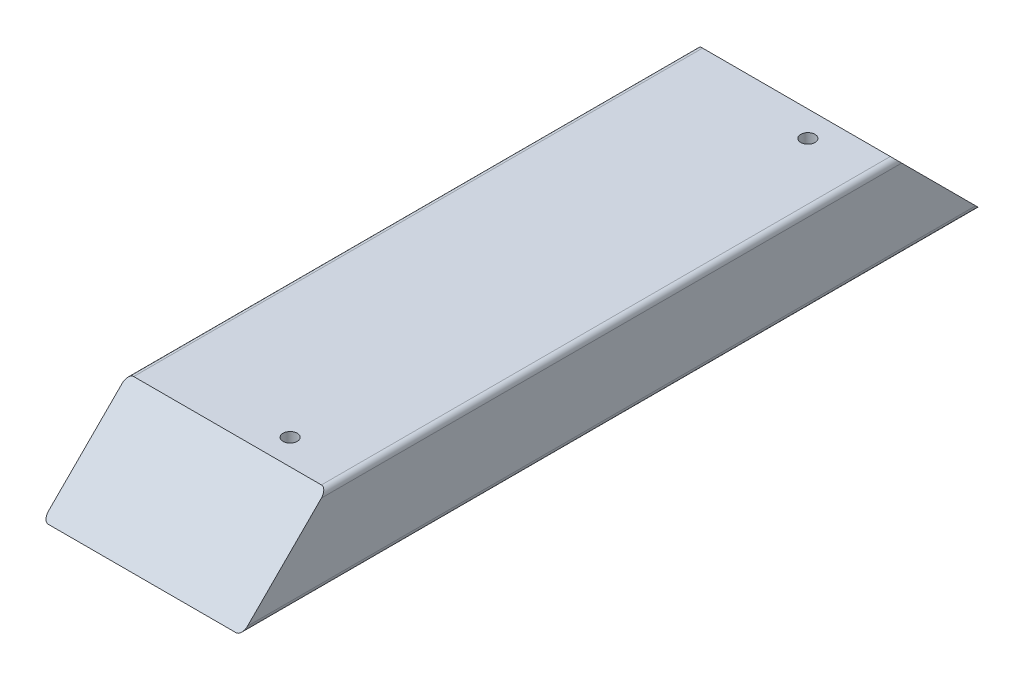
ISO-10303-21;
HEADER;
FILE_DESCRIPTION(('STEP AP214'),'2;1');
FILE_NAME('part.step','',(''),(''),'','','');
FILE_SCHEMA(('AUTOMOTIVE_DESIGN { 1 0 10303 214 1 1 1 1 }'));
ENDSEC;
DATA;
#1=APPLICATION_CONTEXT('core data for automotive mechanical design processes');
#2=APPLICATION_PROTOCOL_DEFINITION('international standard','automotive_design',2000,#1);
#3=PRODUCT_CONTEXT('',#1,'mechanical');
#4=PRODUCT('Part','Part','',(#3));
#5=PRODUCT_RELATED_PRODUCT_CATEGORY('part','',(#4));
#6=PRODUCT_DEFINITION_FORMATION('','',#4);
#7=PRODUCT_DEFINITION_CONTEXT('part definition',#1,'design');
#8=PRODUCT_DEFINITION('design','',#6,#7);
#9=PRODUCT_DEFINITION_SHAPE('','',#8);
#10=(LENGTH_UNIT() NAMED_UNIT(*) SI_UNIT(.MILLI.,.METRE.));
#11=(NAMED_UNIT(*) PLANE_ANGLE_UNIT() SI_UNIT($,.RADIAN.));
#12=(NAMED_UNIT(*) SI_UNIT($,.STERADIAN.) SOLID_ANGLE_UNIT());
#13=UNCERTAINTY_MEASURE_WITH_UNIT(LENGTH_MEASURE(1.E-05),#10,'distance_accuracy_value','');
#14=(GEOMETRIC_REPRESENTATION_CONTEXT(3) GLOBAL_UNCERTAINTY_ASSIGNED_CONTEXT((#13)) GLOBAL_UNIT_ASSIGNED_CONTEXT((#10,
#11,#12)) REPRESENTATION_CONTEXT('',''));
#15=CARTESIAN_POINT('',(0.,0.,0.));
#16=DIRECTION('',(0.,0.,1.));
#17=DIRECTION('',(1.,0.,0.));
#18=AXIS2_PLACEMENT_3D('',#15,#16,#17);
#19=CARTESIAN_POINT('',(44.45,19.05,330.2));
#20=DIRECTION('',(-1.,0.,0.));
#21=DIRECTION('',(0.,-1.,0.));
#22=AXIS2_PLACEMENT_3D('',#19,#20,#21);
#23=PLANE('',#22);
#24=DIRECTION('',(0.,0.707106781186552,-0.707106781186544));
#25=VECTOR('',#24,1.);
#26=CARTESIAN_POINT('',(44.45,2.15105711021124E-13,311.15));
#27=LINE('',#26,#25);
#28=CARTESIAN_POINT('',(44.45,-16.51,327.66));
#29=VERTEX_POINT('',#28);
#30=CARTESIAN_POINT('',(44.45,16.51,294.64));
#31=VERTEX_POINT('',#30);
#32=EDGE_CURVE('E183',#29,#31,#27,.T.);
#33=ORIENTED_EDGE('',*,*,#32,.F.);
#34=DIRECTION('',(0.,0.,-1.));
#35=VECTOR('',#34,1.);
#36=CARTESIAN_POINT('',(44.45,-16.51,330.2));
#37=LINE('',#36,#35);
#38=CARTESIAN_POINT('',(44.45,-16.51,2.53999999999996));
#39=VERTEX_POINT('',#38);
#40=EDGE_CURVE('E121',#29,#39,#37,.T.);
#41=ORIENTED_EDGE('',*,*,#40,.T.);
#42=DIRECTION('',(0.,0.707106781186552,0.707106781186544));
#43=VECTOR('',#42,1.);
#44=CARTESIAN_POINT('',(44.45,165.1,184.149999999998));
#45=LINE('',#44,#43);
#46=CARTESIAN_POINT('',(44.45,16.51,35.5599999999996));
#47=VERTEX_POINT('',#46);
#48=EDGE_CURVE('E181',#39,#47,#45,.T.);
#49=ORIENTED_EDGE('',*,*,#48,.T.);
#50=DIRECTION('',(0.,0.,-1.));
#51=VECTOR('',#50,1.);
#52=CARTESIAN_POINT('',(44.45,16.51,330.2));
#53=LINE('',#52,#51);
#54=EDGE_CURVE('E118',#47,#31,#53,.F.);
#55=ORIENTED_EDGE('',*,*,#54,.T.);
#56=EDGE_LOOP('',(#33,#41,#49,#55));
#57=FACE_BOUND('',#56,.T.);
#58=ADVANCED_FACE('F35',(#57),#23,.F.);
#59=CARTESIAN_POINT('',(-44.45,19.05,330.2));
#60=DIRECTION('',(0.,-1.,0.));
#61=DIRECTION('',(0.,0.,-1.));
#62=AXIS2_PLACEMENT_3D('',#59,#60,#61);
#63=PLANE('',#62);
#64=CARTESIAN_POINT('',(16.51,19.05,280.67));
#65=DIRECTION('',(0.,-1.,0.));
#66=DIRECTION('',(0.,0.,-1.));
#67=AXIS2_PLACEMENT_3D('',#64,#65,#66);
#68=CIRCLE('',#67,3.175);
#69=CARTESIAN_POINT('',(16.51,19.05,277.495));
#70=VERTEX_POINT('',#69);
#71=EDGE_CURVE('E210',#70,#70,#68,.T.);
#72=ORIENTED_EDGE('',*,*,#71,.T.);
#73=EDGE_LOOP('',(#72));
#74=FACE_BOUND('',#73,.T.);
#75=CARTESIAN_POINT('',(16.51,19.05,49.5299999999996));
#76=DIRECTION('',(0.,1.,0.));
#77=DIRECTION('',(0.,0.,1.));
#78=AXIS2_PLACEMENT_3D('',#75,#76,#77);
#79=CIRCLE('',#78,3.175);
#80=CARTESIAN_POINT('',(16.51,19.05,52.7049999999996));
#81=VERTEX_POINT('',#80);
#82=EDGE_CURVE('E204',#81,#81,#79,.T.);
#83=ORIENTED_EDGE('',*,*,#82,.F.);
#84=EDGE_LOOP('',(#83));
#85=FACE_BOUND('',#84,.T.);
#86=DIRECTION('',(-1.,0.,0.));
#87=VECTOR('',#86,1.);
#88=CARTESIAN_POINT('',(361.95,19.05,292.1));
#89=LINE('',#88,#87);
#90=CARTESIAN_POINT('',(41.91,19.05,292.1));
#91=VERTEX_POINT('',#90);
#92=CARTESIAN_POINT('',(-41.91,19.05,292.1));
#93=VERTEX_POINT('',#92);
#94=EDGE_CURVE('E50',#91,#93,#89,.T.);
#95=ORIENTED_EDGE('',*,*,#94,.F.);
#96=DIRECTION('',(0.,0.,-1.));
#97=VECTOR('',#96,1.);
#98=CARTESIAN_POINT('',(41.91,19.05,330.2));
#99=LINE('',#98,#97);
#100=CARTESIAN_POINT('',(41.91,19.05,38.0999999999996));
#101=VERTEX_POINT('',#100);
#102=EDGE_CURVE('E130',#91,#101,#99,.T.);
#103=ORIENTED_EDGE('',*,*,#102,.T.);
#104=DIRECTION('',(-1.,0.,0.));
#105=VECTOR('',#104,1.);
#106=CARTESIAN_POINT('',(361.95,19.05,38.0999999999996));
#107=LINE('',#106,#105);
#108=CARTESIAN_POINT('',(-41.91,19.05,38.0999999999996));
#109=VERTEX_POINT('',#108);
#110=EDGE_CURVE('E136',#101,#109,#107,.T.);
#111=ORIENTED_EDGE('',*,*,#110,.T.);
#112=DIRECTION('',(0.,0.,-1.));
#113=VECTOR('',#112,1.);
#114=CARTESIAN_POINT('',(-41.91,19.05,330.2));
#115=LINE('',#114,#113);
#116=EDGE_CURVE('E127',#109,#93,#115,.F.);
#117=ORIENTED_EDGE('',*,*,#116,.T.);
#118=EDGE_LOOP('',(#95,#103,#111,#117));
#119=FACE_BOUND('',#118,.T.);
#120=ADVANCED_FACE('F141',(#74,#85,#119),#63,.F.);
#121=CARTESIAN_POINT('',(-44.45,19.05,330.2));
#122=DIRECTION('',(1.,0.,0.));
#123=DIRECTION('',(0.,0.,-1.));
#124=AXIS2_PLACEMENT_3D('',#121,#122,#123);
#125=PLANE('',#124);
#126=DIRECTION('',(0.,0.707106781186551,-0.707106781186543));
#127=VECTOR('',#126,1.);
#128=CARTESIAN_POINT('',(-44.45,-19.05,330.2));
#129=LINE('',#128,#127);
#130=CARTESIAN_POINT('',(-44.45,-16.51,327.66));
#131=VERTEX_POINT('',#130);
#132=CARTESIAN_POINT('',(-44.45,16.51,294.64));
#133=VERTEX_POINT('',#132);
#134=EDGE_CURVE('E98',#131,#133,#129,.T.);
#135=ORIENTED_EDGE('',*,*,#134,.T.);
#136=DIRECTION('',(0.,0.,-1.));
#137=VECTOR('',#136,1.);
#138=CARTESIAN_POINT('',(-44.45,16.51,330.2));
#139=LINE('',#138,#137);
#140=CARTESIAN_POINT('',(-44.45,16.51,35.5599999999996));
#141=VERTEX_POINT('',#140);
#142=EDGE_CURVE('E57',#133,#141,#139,.T.);
#143=ORIENTED_EDGE('',*,*,#142,.T.);
#144=DIRECTION('',(0.,0.707106781186551,0.707106781186543));
#145=VECTOR('',#144,1.);
#146=CARTESIAN_POINT('',(-44.45,-19.05,0.));
#147=LINE('',#146,#145);
#148=CARTESIAN_POINT('',(-44.45,-16.51,2.53999999999998));
#149=VERTEX_POINT('',#148);
#150=EDGE_CURVE('E114',#149,#141,#147,.T.);
#151=ORIENTED_EDGE('',*,*,#150,.F.);
#152=DIRECTION('',(0.,0.,-1.));
#153=VECTOR('',#152,1.);
#154=CARTESIAN_POINT('',(-44.45,-16.51,330.2));
#155=LINE('',#154,#153);
#156=EDGE_CURVE('E111',#149,#131,#155,.F.);
#157=ORIENTED_EDGE('',*,*,#156,.T.);
#158=EDGE_LOOP('',(#135,#143,#151,#157));
#159=FACE_BOUND('',#158,.T.);
#160=ADVANCED_FACE('F117',(#159),#125,.F.);
#161=CARTESIAN_POINT('',(-41.91,-16.51,330.2));
#162=DIRECTION('',(0.,0.,-1.));
#163=DIRECTION('',(-1.,0.,0.));
#164=AXIS2_PLACEMENT_3D('',#161,#162,#163);
#165=CYLINDRICAL_SURFACE('',#164,2.54);
#166=DIRECTION('',(0.,0.,-1.));
#167=VECTOR('',#166,1.);
#168=CARTESIAN_POINT('',(-41.91,-19.05,330.2));
#169=LINE('',#168,#167);
#170=CARTESIAN_POINT('',(-41.91,-19.05,330.2));
#171=VERTEX_POINT('',#170);
#172=CARTESIAN_POINT('',(-41.91,-19.05,0.));
#173=VERTEX_POINT('',#172);
#174=EDGE_CURVE('E113',#171,#173,#169,.T.);
#175=ORIENTED_EDGE('',*,*,#174,.F.);
#176=CARTESIAN_POINT('',(-41.91,-16.51,327.66));
#177=DIRECTION('',(0.,0.707106781186543,0.707106781186551));
#178=DIRECTION('',(0.,0.707106781186552,-0.707106781186544));
#179=AXIS2_PLACEMENT_3D('',#176,#177,#178);
#180=ELLIPSE('',#179,3.59210244842764,2.54);
#181=EDGE_CURVE('E101',#171,#131,#180,.F.);
#182=ORIENTED_EDGE('',*,*,#181,.T.);
#183=ORIENTED_EDGE('',*,*,#156,.F.);
#184=CARTESIAN_POINT('',(-41.91,-16.51,2.53999999999993));
#185=DIRECTION('',(0.,-0.707106781186543,0.707106781186551));
#186=DIRECTION('',(0.,-0.707106781186552,-0.707106781186544));
#187=AXIS2_PLACEMENT_3D('',#184,#185,#186);
#188=ELLIPSE('',#187,3.59210244842764,2.54);
#189=EDGE_CURVE('E186',#173,#149,#188,.F.);
#190=ORIENTED_EDGE('',*,*,#189,.F.);
#191=EDGE_LOOP('',(#175,#182,#183,#190));
#192=FACE_BOUND('',#191,.T.);
#193=ADVANCED_FACE('F109',(#192),#165,.T.);
#194=CARTESIAN_POINT('',(41.91,-16.51,330.2));
#195=DIRECTION('',(0.,0.,-1.));
#196=DIRECTION('',(-1.,0.,0.));
#197=AXIS2_PLACEMENT_3D('',#194,#195,#196);
#198=CYLINDRICAL_SURFACE('',#197,2.54);
#199=ORIENTED_EDGE('',*,*,#40,.F.);
#200=CARTESIAN_POINT('',(41.91,-16.51,327.66));
#201=DIRECTION('',(0.,0.707106781186543,0.707106781186551));
#202=DIRECTION('',(0.,0.707106781186552,-0.707106781186544));
#203=AXIS2_PLACEMENT_3D('',#200,#201,#202);
#204=ELLIPSE('',#203,3.59210244842764,2.54);
#205=CARTESIAN_POINT('',(41.91,-19.05,330.2));
#206=VERTEX_POINT('',#205);
#207=EDGE_CURVE('E115',#29,#206,#204,.F.);
#208=ORIENTED_EDGE('',*,*,#207,.T.);
#209=DIRECTION('',(0.,0.,-1.));
#210=VECTOR('',#209,1.);
#211=CARTESIAN_POINT('',(41.91,-19.05,330.2));
#212=LINE('',#211,#210);
#213=CARTESIAN_POINT('',(41.91,-19.05,0.));
#214=VERTEX_POINT('',#213);
#215=EDGE_CURVE('E194',#214,#206,#212,.F.);
#216=ORIENTED_EDGE('',*,*,#215,.F.);
#217=CARTESIAN_POINT('',(41.91,-16.51,2.53999999999993));
#218=DIRECTION('',(0.,-0.707106781186543,0.707106781186551));
#219=DIRECTION('',(0.,-0.707106781186552,-0.707106781186544));
#220=AXIS2_PLACEMENT_3D('',#217,#218,#219);
#221=ELLIPSE('',#220,3.59210244842764,2.54);
#222=EDGE_CURVE('E178',#39,#214,#221,.F.);
#223=ORIENTED_EDGE('',*,*,#222,.F.);
#224=EDGE_LOOP('',(#199,#208,#216,#223));
#225=FACE_BOUND('',#224,.T.);
#226=ADVANCED_FACE('F154',(#225),#198,.T.);
#227=CARTESIAN_POINT('',(41.91,16.51,330.2));
#228=DIRECTION('',(0.,0.,-1.));
#229=DIRECTION('',(-1.,0.,0.));
#230=AXIS2_PLACEMENT_3D('',#227,#228,#229);
#231=CYLINDRICAL_SURFACE('',#230,2.54);
#232=ORIENTED_EDGE('',*,*,#102,.F.);
#233=CARTESIAN_POINT('',(41.91,16.51,294.64));
#234=DIRECTION('',(0.,0.707106781186543,0.707106781186551));
#235=DIRECTION('',(0.,0.707106781186552,-0.707106781186544));
#236=AXIS2_PLACEMENT_3D('',#233,#234,#235);
#237=ELLIPSE('',#236,3.59210244842764,2.54);
#238=EDGE_CURVE('E198',#91,#31,#237,.F.);
#239=ORIENTED_EDGE('',*,*,#238,.T.);
#240=ORIENTED_EDGE('',*,*,#54,.F.);
#241=CARTESIAN_POINT('',(41.91,16.51,35.5599999999996));
#242=DIRECTION('',(0.,-0.707106781186543,0.707106781186551));
#243=DIRECTION('',(0.,-0.707106781186552,-0.707106781186544));
#244=AXIS2_PLACEMENT_3D('',#241,#242,#243);
#245=ELLIPSE('',#244,3.59210244842764,2.54);
#246=EDGE_CURVE('E143',#101,#47,#245,.F.);
#247=ORIENTED_EDGE('',*,*,#246,.F.);
#248=EDGE_LOOP('',(#232,#239,#240,#247));
#249=FACE_BOUND('',#248,.T.);
#250=ADVANCED_FACE('F147',(#249),#231,.T.);
#251=CARTESIAN_POINT('',(-41.91,16.51,330.2));
#252=DIRECTION('',(0.,0.,-1.));
#253=DIRECTION('',(-1.,0.,0.));
#254=AXIS2_PLACEMENT_3D('',#251,#252,#253);
#255=CYLINDRICAL_SURFACE('',#254,2.54);
#256=ORIENTED_EDGE('',*,*,#142,.F.);
#257=CARTESIAN_POINT('',(-41.91,16.51,294.64));
#258=DIRECTION('',(0.,0.707106781186543,0.707106781186551));
#259=DIRECTION('',(0.,0.707106781186552,-0.707106781186544));
#260=AXIS2_PLACEMENT_3D('',#257,#258,#259);
#261=ELLIPSE('',#260,3.59210244842764,2.54);
#262=EDGE_CURVE('E11',#133,#93,#261,.F.);
#263=ORIENTED_EDGE('',*,*,#262,.T.);
#264=ORIENTED_EDGE('',*,*,#116,.F.);
#265=CARTESIAN_POINT('',(-41.91,16.51,35.5599999999996));
#266=DIRECTION('',(0.,-0.707106781186543,0.707106781186551));
#267=DIRECTION('',(0.,-0.707106781186552,-0.707106781186544));
#268=AXIS2_PLACEMENT_3D('',#265,#266,#267);
#269=ELLIPSE('',#268,3.59210244842764,2.54);
#270=EDGE_CURVE('E43',#141,#109,#269,.F.);
#271=ORIENTED_EDGE('',*,*,#270,.F.);
#272=EDGE_LOOP('',(#256,#263,#264,#271));
#273=FACE_BOUND('',#272,.T.);
#274=ADVANCED_FACE('F37',(#273),#255,.T.);
#275=CARTESIAN_POINT('',(-44.45,-19.05,330.2));
#276=DIRECTION('',(0.,1.,0.));
#277=DIRECTION('',(0.,0.,1.));
#278=AXIS2_PLACEMENT_3D('',#275,#276,#277);
#279=PLANE('',#278);
#280=DIRECTION('',(1.,0.,0.));
#281=VECTOR('',#280,1.);
#282=CARTESIAN_POINT('',(-44.45,-19.05,330.2));
#283=LINE('',#282,#281);
#284=EDGE_CURVE('E192',#171,#206,#283,.T.);
#285=ORIENTED_EDGE('',*,*,#284,.F.);
#286=ORIENTED_EDGE('',*,*,#174,.T.);
#287=DIRECTION('',(1.,0.,0.));
#288=VECTOR('',#287,1.);
#289=CARTESIAN_POINT('',(-44.45,-19.05,0.));
#290=LINE('',#289,#288);
#291=EDGE_CURVE('E191',#173,#214,#290,.T.);
#292=ORIENTED_EDGE('',*,*,#291,.T.);
#293=ORIENTED_EDGE('',*,*,#215,.T.);
#294=EDGE_LOOP('',(#285,#286,#292,#293));
#295=FACE_BOUND('',#294,.T.);
#296=ADVANCED_FACE('F146',(#295),#279,.F.);
#297=CARTESIAN_POINT('',(361.95,-19.05,0.));
#298=DIRECTION('',(0.,-0.707106781186543,0.707106781186551));
#299=DIRECTION('',(0.,-0.707106781186552,-0.707106781186544));
#300=AXIS2_PLACEMENT_3D('',#297,#298,#299);
#301=PLANE('',#300);
#302=ORIENTED_EDGE('',*,*,#189,.T.);
#303=ORIENTED_EDGE('',*,*,#150,.T.);
#304=ORIENTED_EDGE('',*,*,#270,.T.);
#305=ORIENTED_EDGE('',*,*,#110,.F.);
#306=ORIENTED_EDGE('',*,*,#246,.T.);
#307=ORIENTED_EDGE('',*,*,#48,.F.);
#308=ORIENTED_EDGE('',*,*,#222,.T.);
#309=ORIENTED_EDGE('',*,*,#291,.F.);
#310=EDGE_LOOP('',(#302,#303,#304,#305,#306,#307,#308,#309));
#311=FACE_BOUND('',#310,.T.);
#312=ADVANCED_FACE('F135',(#311),#301,.F.);
#313=CARTESIAN_POINT('',(361.95,-19.05,330.2));
#314=DIRECTION('',(0.,0.707106781186543,0.707106781186551));
#315=DIRECTION('',(0.,-0.707106781186552,0.707106781186544));
#316=AXIS2_PLACEMENT_3D('',#313,#314,#315);
#317=PLANE('',#316);
#318=ORIENTED_EDGE('',*,*,#284,.T.);
#319=ORIENTED_EDGE('',*,*,#207,.F.);
#320=ORIENTED_EDGE('',*,*,#32,.T.);
#321=ORIENTED_EDGE('',*,*,#238,.F.);
#322=ORIENTED_EDGE('',*,*,#94,.T.);
#323=ORIENTED_EDGE('',*,*,#262,.F.);
#324=ORIENTED_EDGE('',*,*,#134,.F.);
#325=ORIENTED_EDGE('',*,*,#181,.F.);
#326=EDGE_LOOP('',(#318,#319,#320,#321,#322,#323,#324,#325));
#327=FACE_BOUND('',#326,.T.);
#328=ADVANCED_FACE('F100',(#327),#317,.T.);
#329=CARTESIAN_POINT('',(16.51,6.35,49.5299999999996));
#330=DIRECTION('',(0.,1.,0.));
#331=DIRECTION('',(0.,0.,1.));
#332=AXIS2_PLACEMENT_3D('',#329,#330,#331);
#333=CYLINDRICAL_SURFACE('',#332,3.175);
#334=CARTESIAN_POINT('',(16.51,6.35,49.5299999999996));
#335=DIRECTION('',(0.,1.,0.));
#336=DIRECTION('',(0.,0.,1.));
#337=AXIS2_PLACEMENT_3D('',#334,#335,#336);
#338=CIRCLE('',#337,3.175);
#339=CARTESIAN_POINT('',(16.51,6.35,52.7049999999996));
#340=VERTEX_POINT('',#339);
#341=EDGE_CURVE('E104',#340,#340,#338,.T.);
#342=ORIENTED_EDGE('',*,*,#341,.F.);
#343=EDGE_LOOP('',(#342));
#344=FACE_BOUND('',#343,.T.);
#345=ORIENTED_EDGE('',*,*,#82,.T.);
#346=EDGE_LOOP('',(#345));
#347=FACE_BOUND('',#346,.T.);
#348=ADVANCED_FACE('F230',(#344,#347),#333,.F.);
#349=CARTESIAN_POINT('',(16.51,6.35,49.5299999999996));
#350=DIRECTION('',(0.,1.,0.));
#351=DIRECTION('',(0.,0.,1.));
#352=AXIS2_PLACEMENT_3D('',#349,#350,#351);
#353=PLANE('',#352);
#354=ORIENTED_EDGE('',*,*,#341,.T.);
#355=EDGE_LOOP('',(#354));
#356=FACE_BOUND('',#355,.T.);
#357=ADVANCED_FACE('F225',(#356),#353,.T.);
#358=CARTESIAN_POINT('',(16.51,6.35,280.67));
#359=DIRECTION('',(0.,1.,0.));
#360=DIRECTION('',(0.,0.,1.));
#361=AXIS2_PLACEMENT_3D('',#358,#359,#360);
#362=CYLINDRICAL_SURFACE('',#361,3.175);
#363=CARTESIAN_POINT('',(16.51,6.35,280.67));
#364=DIRECTION('',(0.,-1.,0.));
#365=DIRECTION('',(0.,0.,-1.));
#366=AXIS2_PLACEMENT_3D('',#363,#364,#365);
#367=CIRCLE('',#366,3.175);
#368=CARTESIAN_POINT('',(16.51,6.35,277.495));
#369=VERTEX_POINT('',#368);
#370=EDGE_CURVE('E207',#369,#369,#367,.T.);
#371=ORIENTED_EDGE('',*,*,#370,.T.);
#372=EDGE_LOOP('',(#371));
#373=FACE_BOUND('',#372,.T.);
#374=ORIENTED_EDGE('',*,*,#71,.F.);
#375=EDGE_LOOP('',(#374));
#376=FACE_BOUND('',#375,.T.);
#377=ADVANCED_FACE('F216',(#373,#376),#362,.F.);
#378=CARTESIAN_POINT('',(16.51,6.35,280.67));
#379=DIRECTION('',(0.,1.,0.));
#380=DIRECTION('',(0.,0.,-1.));
#381=AXIS2_PLACEMENT_3D('',#378,#379,#380);
#382=PLANE('',#381);
#383=ORIENTED_EDGE('',*,*,#370,.F.);
#384=EDGE_LOOP('',(#383));
#385=FACE_BOUND('',#384,.T.);
#386=ADVANCED_FACE('F219',(#385),#382,.T.);
#387=CLOSED_SHELL('',(#58,#120,#160,#193,#226,#250,#274,#296,#312,#328,#348,#357,#377,#386));
#388=MANIFOLD_SOLID_BREP('B2',#387);
#389=ADVANCED_BREP_SHAPE_REPRESENTATION('',(#18,#388),#14);
#390=SHAPE_DEFINITION_REPRESENTATION(#9,#389);
ENDSEC;
END-ISO-10303-21;
